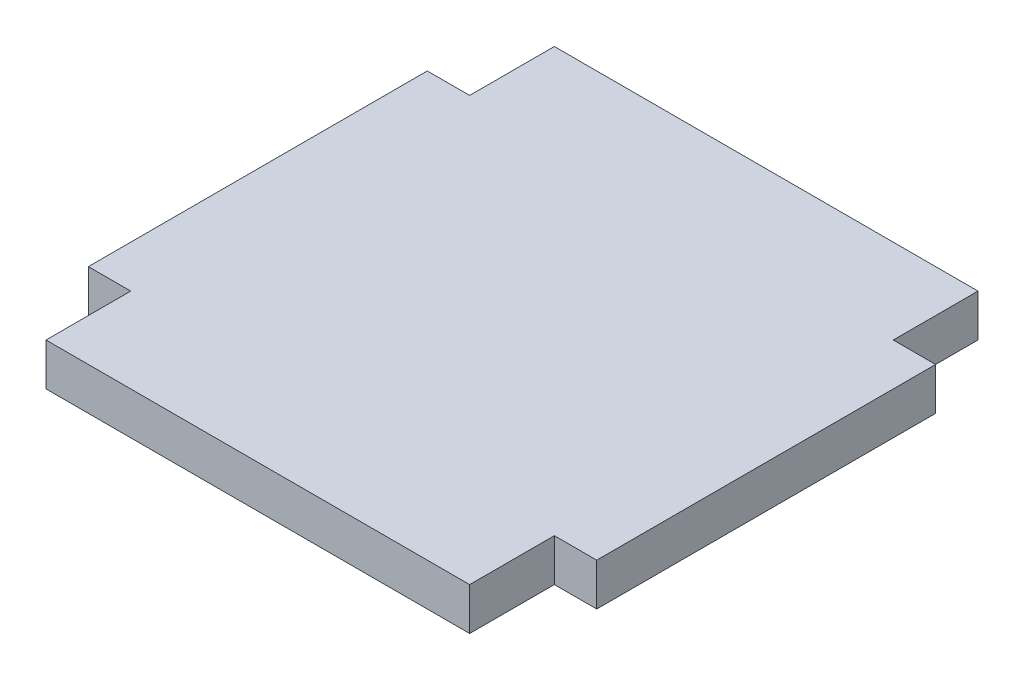
ISO-10303-21;
HEADER;
FILE_DESCRIPTION(('STEP AP214'),'2;1');
FILE_NAME('part.step','',(''),(''),'','','');
FILE_SCHEMA(('AUTOMOTIVE_DESIGN { 1 0 10303 214 1 1 1 1 }'));
ENDSEC;
DATA;
#1=APPLICATION_CONTEXT('core data for automotive mechanical design processes');
#2=APPLICATION_PROTOCOL_DEFINITION('international standard','automotive_design',2000,#1);
#3=PRODUCT_CONTEXT('',#1,'mechanical');
#4=PRODUCT('Part','Part','',(#3));
#5=PRODUCT_RELATED_PRODUCT_CATEGORY('part','',(#4));
#6=PRODUCT_DEFINITION_FORMATION('','',#4);
#7=PRODUCT_DEFINITION_CONTEXT('part definition',#1,'design');
#8=PRODUCT_DEFINITION('design','',#6,#7);
#9=PRODUCT_DEFINITION_SHAPE('','',#8);
#10=(LENGTH_UNIT() NAMED_UNIT(*) SI_UNIT(.MILLI.,.METRE.));
#11=(NAMED_UNIT(*) PLANE_ANGLE_UNIT() SI_UNIT($,.RADIAN.));
#12=(NAMED_UNIT(*) SI_UNIT($,.STERADIAN.) SOLID_ANGLE_UNIT());
#13=UNCERTAINTY_MEASURE_WITH_UNIT(LENGTH_MEASURE(1.E-05),#10,'distance_accuracy_value','');
#14=(GEOMETRIC_REPRESENTATION_CONTEXT(3) GLOBAL_UNCERTAINTY_ASSIGNED_CONTEXT((#13)) GLOBAL_UNIT_ASSIGNED_CONTEXT((#10,
#11,#12)) REPRESENTATION_CONTEXT('',''));
#15=CARTESIAN_POINT('',(0.,0.,0.));
#16=DIRECTION('',(0.,0.,1.));
#17=DIRECTION('',(1.,0.,0.));
#18=AXIS2_PLACEMENT_3D('',#15,#16,#17);
#19=CARTESIAN_POINT('',(0.,3.175,0.));
#20=DIRECTION('',(1.,0.,0.));
#21=DIRECTION('',(0.,0.,-1.));
#22=AXIS2_PLACEMENT_3D('',#19,#20,#21);
#23=PLANE('',#22);
#24=DIRECTION('',(0.,0.,1.));
#25=VECTOR('',#24,1.);
#26=CARTESIAN_POINT('',(0.,3.175,0.));
#27=LINE('',#26,#25);
#28=CARTESIAN_POINT('',(0.,3.175,-31.75));
#29=VERTEX_POINT('',#28);
#30=CARTESIAN_POINT('',(0.,3.175,-6.35));
#31=VERTEX_POINT('',#30);
#32=EDGE_CURVE('E152',#29,#31,#27,.T.);
#33=ORIENTED_EDGE('',*,*,#32,.F.);
#34=DIRECTION('',(0.,-1.,0.));
#35=VECTOR('',#34,1.);
#36=CARTESIAN_POINT('',(0.,3.175,-31.75));
#37=LINE('',#36,#35);
#38=CARTESIAN_POINT('',(0.,0.,-31.75));
#39=VERTEX_POINT('',#38);
#40=EDGE_CURVE('E195',#29,#39,#37,.T.);
#41=ORIENTED_EDGE('',*,*,#40,.T.);
#42=DIRECTION('',(0.,0.,1.));
#43=VECTOR('',#42,1.);
#44=CARTESIAN_POINT('',(0.,0.,0.));
#45=LINE('',#44,#43);
#46=CARTESIAN_POINT('',(0.,0.,-6.35));
#47=VERTEX_POINT('',#46);
#48=EDGE_CURVE('E159',#39,#47,#45,.T.);
#49=ORIENTED_EDGE('',*,*,#48,.T.);
#50=DIRECTION('',(0.,-1.,0.));
#51=VECTOR('',#50,1.);
#52=CARTESIAN_POINT('',(0.,3.175,-6.35));
#53=LINE('',#52,#51);
#54=EDGE_CURVE('E57',#31,#47,#53,.T.);
#55=ORIENTED_EDGE('',*,*,#54,.F.);
#56=EDGE_LOOP('',(#33,#41,#49,#55));
#57=FACE_BOUND('',#56,.T.);
#58=ADVANCED_FACE('F33',(#57),#23,.F.);
#59=CARTESIAN_POINT('',(0.,3.175,0.));
#60=DIRECTION('',(0.,0.,-1.));
#61=DIRECTION('',(-1.,0.,0.));
#62=AXIS2_PLACEMENT_3D('',#59,#60,#61);
#63=PLANE('',#62);
#64=DIRECTION('',(1.,0.,0.));
#65=VECTOR('',#64,1.);
#66=CARTESIAN_POINT('',(0.,0.,0.));
#67=LINE('',#66,#65);
#68=CARTESIAN_POINT('',(3.175,0.,0.));
#69=VERTEX_POINT('',#68);
#70=CARTESIAN_POINT('',(34.925,0.,0.));
#71=VERTEX_POINT('',#70);
#72=EDGE_CURVE('E145',#69,#71,#67,.T.);
#73=ORIENTED_EDGE('',*,*,#72,.T.);
#74=DIRECTION('',(0.,-1.,0.));
#75=VECTOR('',#74,1.);
#76=CARTESIAN_POINT('',(34.925,3.175,0.));
#77=LINE('',#76,#75);
#78=CARTESIAN_POINT('',(34.925,3.175,0.));
#79=VERTEX_POINT('',#78);
#80=EDGE_CURVE('E128',#79,#71,#77,.T.);
#81=ORIENTED_EDGE('',*,*,#80,.F.);
#82=DIRECTION('',(1.,0.,0.));
#83=VECTOR('',#82,1.);
#84=CARTESIAN_POINT('',(0.,3.175,0.));
#85=LINE('',#84,#83);
#86=CARTESIAN_POINT('',(3.175,3.175,0.));
#87=VERTEX_POINT('',#86);
#88=EDGE_CURVE('E143',#87,#79,#85,.T.);
#89=ORIENTED_EDGE('',*,*,#88,.F.);
#90=DIRECTION('',(0.,-1.,0.));
#91=VECTOR('',#90,1.);
#92=CARTESIAN_POINT('',(3.175,3.175,0.));
#93=LINE('',#92,#91);
#94=EDGE_CURVE('E185',#87,#69,#93,.T.);
#95=ORIENTED_EDGE('',*,*,#94,.T.);
#96=EDGE_LOOP('',(#73,#81,#89,#95));
#97=FACE_BOUND('',#96,.T.);
#98=ADVANCED_FACE('F141',(#97),#63,.F.);
#99=CARTESIAN_POINT('',(38.1,3.175,0.));
#100=DIRECTION('',(-1.,0.,0.));
#101=DIRECTION('',(0.,0.,1.));
#102=AXIS2_PLACEMENT_3D('',#99,#100,#101);
#103=PLANE('',#102);
#104=DIRECTION('',(0.,0.,-1.));
#105=VECTOR('',#104,1.);
#106=CARTESIAN_POINT('',(38.1,3.175,0.));
#107=LINE('',#106,#105);
#108=CARTESIAN_POINT('',(38.1,3.175,-6.35));
#109=VERTEX_POINT('',#108);
#110=CARTESIAN_POINT('',(38.1,3.175,-31.75));
#111=VERTEX_POINT('',#110);
#112=EDGE_CURVE('E41',#109,#111,#107,.T.);
#113=ORIENTED_EDGE('',*,*,#112,.F.);
#114=DIRECTION('',(0.,-1.,0.));
#115=VECTOR('',#114,1.);
#116=CARTESIAN_POINT('',(38.1,3.175,-6.35));
#117=LINE('',#116,#115);
#118=CARTESIAN_POINT('',(38.1,0.,-6.35));
#119=VERTEX_POINT('',#118);
#120=EDGE_CURVE('E221',#109,#119,#117,.T.);
#121=ORIENTED_EDGE('',*,*,#120,.T.);
#122=DIRECTION('',(0.,0.,-1.));
#123=VECTOR('',#122,1.);
#124=CARTESIAN_POINT('',(38.1,0.,0.));
#125=LINE('',#124,#123);
#126=CARTESIAN_POINT('',(38.1,0.,-31.75));
#127=VERTEX_POINT('',#126);
#128=EDGE_CURVE('E163',#119,#127,#125,.T.);
#129=ORIENTED_EDGE('',*,*,#128,.T.);
#130=DIRECTION('',(0.,-1.,0.));
#131=VECTOR('',#130,1.);
#132=CARTESIAN_POINT('',(38.1,3.175,-31.75));
#133=LINE('',#132,#131);
#134=EDGE_CURVE('E217',#111,#127,#133,.T.);
#135=ORIENTED_EDGE('',*,*,#134,.F.);
#136=EDGE_LOOP('',(#113,#121,#129,#135));
#137=FACE_BOUND('',#136,.T.);
#138=ADVANCED_FACE('F260',(#137),#103,.F.);
#139=CARTESIAN_POINT('',(0.,3.175,-38.1));
#140=DIRECTION('',(0.,0.,1.));
#141=DIRECTION('',(1.,0.,0.));
#142=AXIS2_PLACEMENT_3D('',#139,#140,#141);
#143=PLANE('',#142);
#144=DIRECTION('',(-1.,0.,0.));
#145=VECTOR('',#144,1.);
#146=CARTESIAN_POINT('',(0.,0.,-38.1));
#147=LINE('',#146,#145);
#148=CARTESIAN_POINT('',(34.925,0.,-38.1));
#149=VERTEX_POINT('',#148);
#150=CARTESIAN_POINT('',(3.175,0.,-38.1));
#151=VERTEX_POINT('',#150);
#152=EDGE_CURVE('E36',#149,#151,#147,.T.);
#153=ORIENTED_EDGE('',*,*,#152,.T.);
#154=DIRECTION('',(0.,-1.,0.));
#155=VECTOR('',#154,1.);
#156=CARTESIAN_POINT('',(3.175,3.175,-38.1));
#157=LINE('',#156,#155);
#158=CARTESIAN_POINT('',(3.175,3.175,-38.1));
#159=VERTEX_POINT('',#158);
#160=EDGE_CURVE('E49',#159,#151,#157,.T.);
#161=ORIENTED_EDGE('',*,*,#160,.F.);
#162=DIRECTION('',(-1.,0.,0.));
#163=VECTOR('',#162,1.);
#164=CARTESIAN_POINT('',(0.,3.175,-38.1));
#165=LINE('',#164,#163);
#166=CARTESIAN_POINT('',(34.925,3.175,-38.1));
#167=VERTEX_POINT('',#166);
#168=EDGE_CURVE('E11',#167,#159,#165,.T.);
#169=ORIENTED_EDGE('',*,*,#168,.F.);
#170=DIRECTION('',(0.,-1.,0.));
#171=VECTOR('',#170,1.);
#172=CARTESIAN_POINT('',(34.925,3.175,-38.1));
#173=LINE('',#172,#171);
#174=EDGE_CURVE('E162',#167,#149,#173,.T.);
#175=ORIENTED_EDGE('',*,*,#174,.T.);
#176=EDGE_LOOP('',(#153,#161,#169,#175));
#177=FACE_BOUND('',#176,.T.);
#178=ADVANCED_FACE('F173',(#177),#143,.F.);
#179=CARTESIAN_POINT('',(0.,3.175,0.));
#180=DIRECTION('',(0.,-1.,0.));
#181=DIRECTION('',(0.,0.,-1.));
#182=AXIS2_PLACEMENT_3D('',#179,#180,#181);
#183=PLANE('',#182);
#184=DIRECTION('',(0.,0.,-1.));
#185=VECTOR('',#184,1.);
#186=CARTESIAN_POINT('',(34.925,3.175,0.));
#187=LINE('',#186,#185);
#188=CARTESIAN_POINT('',(34.925,3.175,-6.35));
#189=VERTEX_POINT('',#188);
#190=EDGE_CURVE('E124',#79,#189,#187,.T.);
#191=ORIENTED_EDGE('',*,*,#190,.T.);
#192=DIRECTION('',(1.,0.,0.));
#193=VECTOR('',#192,1.);
#194=CARTESIAN_POINT('',(38.1,3.175,-6.35));
#195=LINE('',#194,#193);
#196=EDGE_CURVE('E135',#189,#109,#195,.T.);
#197=ORIENTED_EDGE('',*,*,#196,.T.);
#198=ORIENTED_EDGE('',*,*,#112,.T.);
#199=DIRECTION('',(-1.,0.,0.));
#200=VECTOR('',#199,1.);
#201=CARTESIAN_POINT('',(38.1,3.175,-31.75));
#202=LINE('',#201,#200);
#203=CARTESIAN_POINT('',(34.925,3.175,-31.75));
#204=VERTEX_POINT('',#203);
#205=EDGE_CURVE('E211',#111,#204,#202,.T.);
#206=ORIENTED_EDGE('',*,*,#205,.T.);
#207=DIRECTION('',(0.,0.,-1.));
#208=VECTOR('',#207,1.);
#209=CARTESIAN_POINT('',(34.925,3.175,-38.1));
#210=LINE('',#209,#208);
#211=EDGE_CURVE('E214',#204,#167,#210,.T.);
#212=ORIENTED_EDGE('',*,*,#211,.T.);
#213=ORIENTED_EDGE('',*,*,#168,.T.);
#214=DIRECTION('',(0.,0.,1.));
#215=VECTOR('',#214,1.);
#216=CARTESIAN_POINT('',(3.175,3.175,-38.1));
#217=LINE('',#216,#215);
#218=CARTESIAN_POINT('',(3.175,3.175,-31.75));
#219=VERTEX_POINT('',#218);
#220=EDGE_CURVE('E187',#159,#219,#217,.T.);
#221=ORIENTED_EDGE('',*,*,#220,.T.);
#222=DIRECTION('',(-1.,0.,0.));
#223=VECTOR('',#222,1.);
#224=CARTESIAN_POINT('',(0.,3.175,-31.75));
#225=LINE('',#224,#223);
#226=EDGE_CURVE('E192',#219,#29,#225,.T.);
#227=ORIENTED_EDGE('',*,*,#226,.T.);
#228=ORIENTED_EDGE('',*,*,#32,.T.);
#229=DIRECTION('',(1.,0.,0.));
#230=VECTOR('',#229,1.);
#231=CARTESIAN_POINT('',(0.,3.175,-6.35));
#232=LINE('',#231,#230);
#233=CARTESIAN_POINT('',(3.175,3.175,-6.35));
#234=VERTEX_POINT('',#233);
#235=EDGE_CURVE('E202',#31,#234,#232,.T.);
#236=ORIENTED_EDGE('',*,*,#235,.T.);
#237=DIRECTION('',(0.,0.,1.));
#238=VECTOR('',#237,1.);
#239=CARTESIAN_POINT('',(3.175,3.175,0.));
#240=LINE('',#239,#238);
#241=EDGE_CURVE('E151',#234,#87,#240,.T.);
#242=ORIENTED_EDGE('',*,*,#241,.T.);
#243=ORIENTED_EDGE('',*,*,#88,.T.);
#244=EDGE_LOOP('',(#191,#197,#198,#206,#212,#213,#221,#227,#228,#236,#242,#243));
#245=FACE_BOUND('',#244,.T.);
#246=ADVANCED_FACE('F148',(#245),#183,.F.);
#247=CARTESIAN_POINT('',(0.,0.,0.));
#248=DIRECTION('',(0.,-1.,0.));
#249=DIRECTION('',(0.,0.,-1.));
#250=AXIS2_PLACEMENT_3D('',#247,#248,#249);
#251=PLANE('',#250);
#252=DIRECTION('',(1.,0.,0.));
#253=VECTOR('',#252,1.);
#254=CARTESIAN_POINT('',(38.1,0.,-6.35));
#255=LINE('',#254,#253);
#256=CARTESIAN_POINT('',(34.925,0.,-6.35));
#257=VERTEX_POINT('',#256);
#258=EDGE_CURVE('E136',#257,#119,#255,.T.);
#259=ORIENTED_EDGE('',*,*,#258,.F.);
#260=DIRECTION('',(0.,0.,-1.));
#261=VECTOR('',#260,1.);
#262=CARTESIAN_POINT('',(34.925,0.,0.));
#263=LINE('',#262,#261);
#264=EDGE_CURVE('E198',#71,#257,#263,.T.);
#265=ORIENTED_EDGE('',*,*,#264,.F.);
#266=ORIENTED_EDGE('',*,*,#72,.F.);
#267=DIRECTION('',(0.,0.,1.));
#268=VECTOR('',#267,1.);
#269=CARTESIAN_POINT('',(3.175,0.,0.));
#270=LINE('',#269,#268);
#271=CARTESIAN_POINT('',(3.175,0.,-6.35));
#272=VERTEX_POINT('',#271);
#273=EDGE_CURVE('E204',#272,#69,#270,.T.);
#274=ORIENTED_EDGE('',*,*,#273,.F.);
#275=DIRECTION('',(1.,0.,0.));
#276=VECTOR('',#275,1.);
#277=CARTESIAN_POINT('',(0.,0.,-6.35));
#278=LINE('',#277,#276);
#279=EDGE_CURVE('E206',#47,#272,#278,.T.);
#280=ORIENTED_EDGE('',*,*,#279,.F.);
#281=ORIENTED_EDGE('',*,*,#48,.F.);
#282=DIRECTION('',(-1.,0.,0.));
#283=VECTOR('',#282,1.);
#284=CARTESIAN_POINT('',(0.,0.,-31.75));
#285=LINE('',#284,#283);
#286=CARTESIAN_POINT('',(3.175,0.,-31.75));
#287=VERTEX_POINT('',#286);
#288=EDGE_CURVE('E184',#287,#39,#285,.T.);
#289=ORIENTED_EDGE('',*,*,#288,.F.);
#290=DIRECTION('',(0.,0.,1.));
#291=VECTOR('',#290,1.);
#292=CARTESIAN_POINT('',(3.175,0.,-38.1));
#293=LINE('',#292,#291);
#294=EDGE_CURVE('E182',#151,#287,#293,.T.);
#295=ORIENTED_EDGE('',*,*,#294,.F.);
#296=ORIENTED_EDGE('',*,*,#152,.F.);
#297=DIRECTION('',(0.,0.,-1.));
#298=VECTOR('',#297,1.);
#299=CARTESIAN_POINT('',(34.925,0.,-38.1));
#300=LINE('',#299,#298);
#301=CARTESIAN_POINT('',(34.925,0.,-31.75));
#302=VERTEX_POINT('',#301);
#303=EDGE_CURVE('E180',#302,#149,#300,.T.);
#304=ORIENTED_EDGE('',*,*,#303,.F.);
#305=DIRECTION('',(-1.,0.,0.));
#306=VECTOR('',#305,1.);
#307=CARTESIAN_POINT('',(38.1,0.,-31.75));
#308=LINE('',#307,#306);
#309=EDGE_CURVE('E218',#127,#302,#308,.T.);
#310=ORIENTED_EDGE('',*,*,#309,.F.);
#311=ORIENTED_EDGE('',*,*,#128,.F.);
#312=EDGE_LOOP('',(#259,#265,#266,#274,#280,#281,#289,#295,#296,#304,#310,#311));
#313=FACE_BOUND('',#312,.T.);
#314=ADVANCED_FACE('F178',(#313),#251,.T.);
#315=CARTESIAN_POINT('',(34.925,3.175,-38.1));
#316=DIRECTION('',(-1.,0.,0.));
#317=DIRECTION('',(0.,0.,1.));
#318=AXIS2_PLACEMENT_3D('',#315,#316,#317);
#319=PLANE('',#318);
#320=ORIENTED_EDGE('',*,*,#303,.T.);
#321=ORIENTED_EDGE('',*,*,#174,.F.);
#322=ORIENTED_EDGE('',*,*,#211,.F.);
#323=DIRECTION('',(0.,-1.,0.));
#324=VECTOR('',#323,1.);
#325=CARTESIAN_POINT('',(34.925,3.175,-31.75));
#326=LINE('',#325,#324);
#327=EDGE_CURVE('E224',#204,#302,#326,.T.);
#328=ORIENTED_EDGE('',*,*,#327,.T.);
#329=EDGE_LOOP('',(#320,#321,#322,#328));
#330=FACE_BOUND('',#329,.T.);
#331=ADVANCED_FACE('F253',(#330),#319,.F.);
#332=CARTESIAN_POINT('',(38.1,3.175,-31.75));
#333=DIRECTION('',(0.,0.,1.));
#334=DIRECTION('',(1.,0.,0.));
#335=AXIS2_PLACEMENT_3D('',#332,#333,#334);
#336=PLANE('',#335);
#337=ORIENTED_EDGE('',*,*,#309,.T.);
#338=ORIENTED_EDGE('',*,*,#327,.F.);
#339=ORIENTED_EDGE('',*,*,#205,.F.);
#340=ORIENTED_EDGE('',*,*,#134,.T.);
#341=EDGE_LOOP('',(#337,#338,#339,#340));
#342=FACE_BOUND('',#341,.T.);
#343=ADVANCED_FACE('F227',(#342),#336,.F.);
#344=CARTESIAN_POINT('',(3.175,3.175,0.));
#345=DIRECTION('',(1.,0.,0.));
#346=DIRECTION('',(0.,0.,-1.));
#347=AXIS2_PLACEMENT_3D('',#344,#345,#346);
#348=PLANE('',#347);
#349=ORIENTED_EDGE('',*,*,#273,.T.);
#350=ORIENTED_EDGE('',*,*,#94,.F.);
#351=ORIENTED_EDGE('',*,*,#241,.F.);
#352=DIRECTION('',(0.,-1.,0.));
#353=VECTOR('',#352,1.);
#354=CARTESIAN_POINT('',(3.175,3.175,-6.35));
#355=LINE('',#354,#353);
#356=EDGE_CURVE('E189',#234,#272,#355,.T.);
#357=ORIENTED_EDGE('',*,*,#356,.T.);
#358=EDGE_LOOP('',(#349,#350,#351,#357));
#359=FACE_BOUND('',#358,.T.);
#360=ADVANCED_FACE('F244',(#359),#348,.F.);
#361=CARTESIAN_POINT('',(0.,3.175,-6.35));
#362=DIRECTION('',(0.,0.,-1.));
#363=DIRECTION('',(-1.,0.,0.));
#364=AXIS2_PLACEMENT_3D('',#361,#362,#363);
#365=PLANE('',#364);
#366=ORIENTED_EDGE('',*,*,#279,.T.);
#367=ORIENTED_EDGE('',*,*,#356,.F.);
#368=ORIENTED_EDGE('',*,*,#235,.F.);
#369=ORIENTED_EDGE('',*,*,#54,.T.);
#370=EDGE_LOOP('',(#366,#367,#368,#369));
#371=FACE_BOUND('',#370,.T.);
#372=ADVANCED_FACE('F242',(#371),#365,.F.);
#373=CARTESIAN_POINT('',(0.,3.175,-31.75));
#374=DIRECTION('',(0.,0.,1.));
#375=DIRECTION('',(1.,0.,0.));
#376=AXIS2_PLACEMENT_3D('',#373,#374,#375);
#377=PLANE('',#376);
#378=ORIENTED_EDGE('',*,*,#288,.T.);
#379=ORIENTED_EDGE('',*,*,#40,.F.);
#380=ORIENTED_EDGE('',*,*,#226,.F.);
#381=DIRECTION('',(0.,-1.,0.));
#382=VECTOR('',#381,1.);
#383=CARTESIAN_POINT('',(3.175,3.175,-31.75));
#384=LINE('',#383,#382);
#385=EDGE_CURVE('E199',#219,#287,#384,.T.);
#386=ORIENTED_EDGE('',*,*,#385,.T.);
#387=EDGE_LOOP('',(#378,#379,#380,#386));
#388=FACE_BOUND('',#387,.T.);
#389=ADVANCED_FACE('F251',(#388),#377,.F.);
#390=CARTESIAN_POINT('',(3.175,3.175,-38.1));
#391=DIRECTION('',(1.,0.,0.));
#392=DIRECTION('',(0.,0.,-1.));
#393=AXIS2_PLACEMENT_3D('',#390,#391,#392);
#394=PLANE('',#393);
#395=ORIENTED_EDGE('',*,*,#294,.T.);
#396=ORIENTED_EDGE('',*,*,#385,.F.);
#397=ORIENTED_EDGE('',*,*,#220,.F.);
#398=ORIENTED_EDGE('',*,*,#160,.T.);
#399=EDGE_LOOP('',(#395,#396,#397,#398));
#400=FACE_BOUND('',#399,.T.);
#401=ADVANCED_FACE('F279',(#400),#394,.F.);
#402=CARTESIAN_POINT('',(38.1,3.175,-6.35));
#403=DIRECTION('',(0.,0.,-1.));
#404=DIRECTION('',(-1.,0.,0.));
#405=AXIS2_PLACEMENT_3D('',#402,#403,#404);
#406=PLANE('',#405);
#407=ORIENTED_EDGE('',*,*,#258,.T.);
#408=ORIENTED_EDGE('',*,*,#120,.F.);
#409=ORIENTED_EDGE('',*,*,#196,.F.);
#410=DIRECTION('',(0.,-1.,0.));
#411=VECTOR('',#410,1.);
#412=CARTESIAN_POINT('',(34.925,3.175,-6.35));
#413=LINE('',#412,#411);
#414=EDGE_CURVE('E130',#189,#257,#413,.T.);
#415=ORIENTED_EDGE('',*,*,#414,.T.);
#416=EDGE_LOOP('',(#407,#408,#409,#415));
#417=FACE_BOUND('',#416,.T.);
#418=ADVANCED_FACE('F277',(#417),#406,.F.);
#419=CARTESIAN_POINT('',(34.925,3.175,0.));
#420=DIRECTION('',(-1.,0.,0.));
#421=DIRECTION('',(0.,0.,1.));
#422=AXIS2_PLACEMENT_3D('',#419,#420,#421);
#423=PLANE('',#422);
#424=ORIENTED_EDGE('',*,*,#264,.T.);
#425=ORIENTED_EDGE('',*,*,#414,.F.);
#426=ORIENTED_EDGE('',*,*,#190,.F.);
#427=ORIENTED_EDGE('',*,*,#80,.T.);
#428=EDGE_LOOP('',(#424,#425,#426,#427));
#429=FACE_BOUND('',#428,.T.);
#430=ADVANCED_FACE('F127',(#429),#423,.F.);
#431=CLOSED_SHELL('',(#58,#98,#138,#178,#246,#314,#331,#343,#360,#372,#389,#401,#418,#430));
#432=MANIFOLD_SOLID_BREP('B2',#431);
#433=ADVANCED_BREP_SHAPE_REPRESENTATION('',(#18,#432),#14);
#434=SHAPE_DEFINITION_REPRESENTATION(#9,#433);
ENDSEC;
END-ISO-10303-21;
